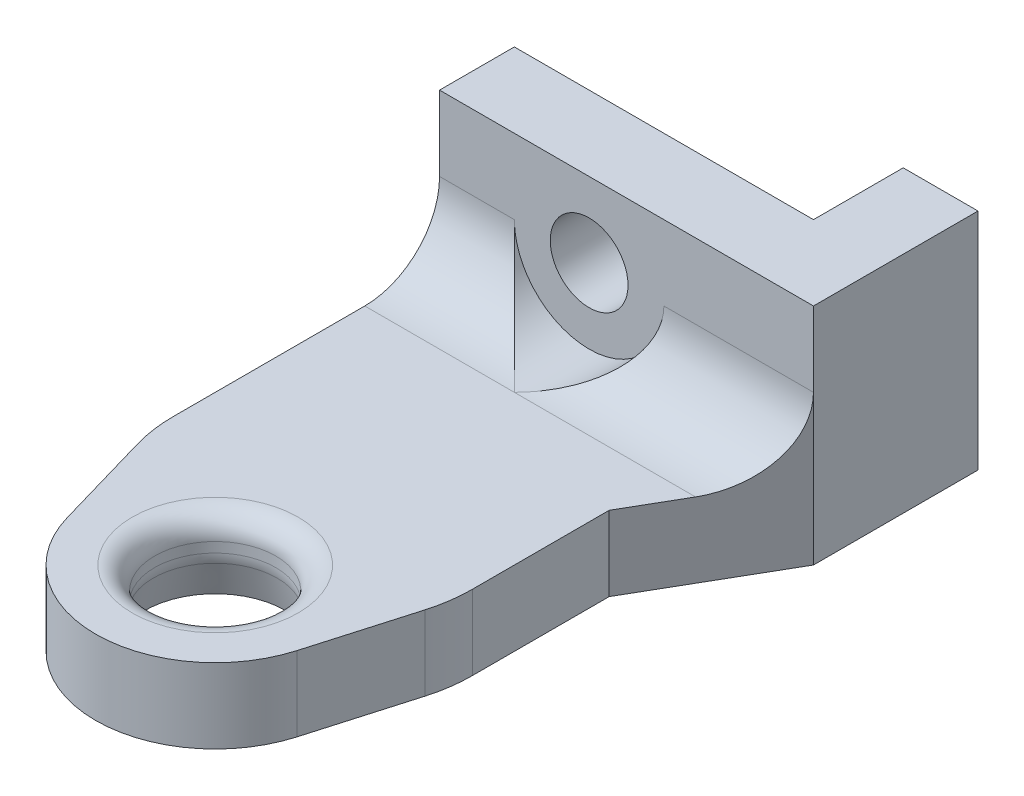
ISO-10303-21;
HEADER;
FILE_DESCRIPTION(('STEP AP214'),'2;1');
FILE_NAME('part.step','',(''),(''),'','','');
FILE_SCHEMA(('AUTOMOTIVE_DESIGN { 1 0 10303 214 1 1 1 1 }'));
ENDSEC;
DATA;
#1=APPLICATION_CONTEXT('core data for automotive mechanical design processes');
#2=APPLICATION_PROTOCOL_DEFINITION('international standard','automotive_design',2000,#1);
#3=PRODUCT_CONTEXT('',#1,'mechanical');
#4=PRODUCT('Part','Part','',(#3));
#5=PRODUCT_RELATED_PRODUCT_CATEGORY('part','',(#4));
#6=PRODUCT_DEFINITION_FORMATION('','',#4);
#7=PRODUCT_DEFINITION_CONTEXT('part definition',#1,'design');
#8=PRODUCT_DEFINITION('design','',#6,#7);
#9=PRODUCT_DEFINITION_SHAPE('','',#8);
#10=(LENGTH_UNIT() NAMED_UNIT(*) SI_UNIT(.MILLI.,.METRE.));
#11=(NAMED_UNIT(*) PLANE_ANGLE_UNIT() SI_UNIT($,.RADIAN.));
#12=(NAMED_UNIT(*) SI_UNIT($,.STERADIAN.) SOLID_ANGLE_UNIT());
#13=UNCERTAINTY_MEASURE_WITH_UNIT(LENGTH_MEASURE(1.E-05),#10,'distance_accuracy_value','');
#14=(GEOMETRIC_REPRESENTATION_CONTEXT(3) GLOBAL_UNCERTAINTY_ASSIGNED_CONTEXT((#13)) GLOBAL_UNIT_ASSIGNED_CONTEXT((#10,
#11,#12)) REPRESENTATION_CONTEXT('',''));
#15=CARTESIAN_POINT('',(0.,0.,0.));
#16=DIRECTION('',(0.,0.,1.));
#17=DIRECTION('',(1.,0.,0.));
#18=AXIS2_PLACEMENT_3D('',#15,#16,#17);
#19=CARTESIAN_POINT('',(20.,5.,0.));
#20=DIRECTION('',(0.,-1.,0.));
#21=DIRECTION('',(0.,0.,-1.));
#22=AXIS2_PLACEMENT_3D('',#19,#20,#21);
#23=CYLINDRICAL_SURFACE('',#22,4.05);
#24=CARTESIAN_POINT('',(20.,2.8291312439685,0.));
#25=DIRECTION('',(0.,1.,0.));
#26=DIRECTION('',(0.,0.,1.));
#27=AXIS2_PLACEMENT_3D('',#24,#25,#26);
#28=CIRCLE('',#27,4.05);
#29=CARTESIAN_POINT('',(20.,2.8291312439685,4.04999999999996));
#30=VERTEX_POINT('',#29);
#31=EDGE_CURVE('E162',#30,#30,#28,.T.);
#32=ORIENTED_EDGE('',*,*,#31,.F.);
#33=EDGE_LOOP('',(#32));
#34=FACE_BOUND('',#33,.T.);
#35=CARTESIAN_POINT('',(20.,3.5,0.));
#36=DIRECTION('',(0.,-1.,0.));
#37=DIRECTION('',(0.,0.,-1.));
#38=AXIS2_PLACEMENT_3D('',#35,#36,#37);
#39=CIRCLE('',#38,4.05);
#40=CARTESIAN_POINT('',(20.,3.5,-4.05000000000004));
#41=VERTEX_POINT('',#40);
#42=EDGE_CURVE('E245',#41,#41,#39,.T.);
#43=ORIENTED_EDGE('',*,*,#42,.F.);
#44=EDGE_LOOP('',(#43));
#45=FACE_BOUND('',#44,.T.);
#46=ADVANCED_FACE('F16',(#34,#45),#23,.F.);
#47=CARTESIAN_POINT('',(20.,10.,7.99999999999997));
#48=DIRECTION('',(0.,0.,-1.));
#49=DIRECTION('',(-1.,0.,0.));
#50=AXIS2_PLACEMENT_3D('',#47,#48,#49);
#51=CYLINDRICAL_SURFACE('',#50,5.);
#52=CARTESIAN_POINT('',(20.,10.,-20.));
#53=DIRECTION('',(-0.707106781186549,0.,-0.707106781186546));
#54=DIRECTION('',(0.707106781186546,0.,-0.707106781186549));
#55=AXIS2_PLACEMENT_3D('',#52,#53,#54);
#56=ELLIPSE('',#55,7.07106781186548,5.);
#57=CARTESIAN_POINT('',(20.,5.,-20.));
#58=VERTEX_POINT('',#57);
#59=CARTESIAN_POINT('',(25.,10.,-25.));
#60=VERTEX_POINT('',#59);
#61=EDGE_CURVE('E166',#58,#60,#56,.F.);
#62=ORIENTED_EDGE('',*,*,#61,.T.);
#63=CARTESIAN_POINT('',(20.,10.,-25.));
#64=DIRECTION('',(0.,0.,-1.));
#65=DIRECTION('',(-1.,0.,0.));
#66=AXIS2_PLACEMENT_3D('',#63,#64,#65);
#67=CIRCLE('',#66,5.);
#68=CARTESIAN_POINT('',(15.,10.,-25.));
#69=VERTEX_POINT('',#68);
#70=EDGE_CURVE('E164',#69,#60,#67,.F.);
#71=ORIENTED_EDGE('',*,*,#70,.F.);
#72=CARTESIAN_POINT('',(20.,10.,-20.));
#73=DIRECTION('',(0.707106781186546,0.,-0.707106781186549));
#74=DIRECTION('',(-0.707106781186549,0.,-0.707106781186546));
#75=AXIS2_PLACEMENT_3D('',#72,#73,#74);
#76=ELLIPSE('',#75,7.07106781186548,5.);
#77=EDGE_CURVE('E150',#69,#58,#76,.F.);
#78=ORIENTED_EDGE('',*,*,#77,.T.);
#79=EDGE_LOOP('',(#62,#71,#78));
#80=FACE_BOUND('',#79,.T.);
#81=ADVANCED_FACE('F165',(#80),#51,.F.);
#82=CARTESIAN_POINT('',(20.,3.5,0.));
#83=DIRECTION('',(0.,-1.,0.));
#84=DIRECTION('',(0.,0.,-1.));
#85=AXIS2_PLACEMENT_3D('',#82,#83,#84);
#86=TOROIDAL_SURFACE('',#85,5.55,1.5);
#87=ORIENTED_EDGE('',*,*,#42,.T.);
#88=EDGE_LOOP('',(#87));
#89=FACE_BOUND('',#88,.T.);
#90=CARTESIAN_POINT('',(20.,5.,0.));
#91=DIRECTION('',(0.,1.,0.));
#92=DIRECTION('',(0.,0.,-1.));
#93=AXIS2_PLACEMENT_3D('',#90,#91,#92);
#94=CIRCLE('',#93,5.55);
#95=CARTESIAN_POINT('',(20.,5.,-5.55000000000004));
#96=VERTEX_POINT('',#95);
#97=CARTESIAN_POINT('',(20.,5.,5.54999999999996));
#98=VERTEX_POINT('',#97);
#99=EDGE_CURVE('E232',#96,#98,#94,.T.);
#100=ORIENTED_EDGE('',*,*,#99,.T.);
#101=CARTESIAN_POINT('',(20.,5.,0.));
#102=DIRECTION('',(0.,1.,0.));
#103=DIRECTION('',(0.,0.,1.));
#104=AXIS2_PLACEMENT_3D('',#101,#102,#103);
#105=CIRCLE('',#104,5.55);
#106=EDGE_CURVE('E291',#98,#96,#105,.T.);
#107=ORIENTED_EDGE('',*,*,#106,.T.);
#108=EDGE_LOOP('',(#100,#107));
#109=FACE_BOUND('',#108,.T.);
#110=ADVANCED_FACE('F220',(#89,#109),#86,.T.);
#111=CARTESIAN_POINT('',(20.,2.8291312439685,0.));
#112=DIRECTION('',(0.,1.,0.));
#113=DIRECTION('',(0.,0.,1.));
#114=AXIS2_PLACEMENT_3D('',#111,#112,#113);
#115=TOROIDAL_SURFACE('',#114,6.55,2.5);
#116=ORIENTED_EDGE('',*,*,#31,.T.);
#117=EDGE_LOOP('',(#116));
#118=FACE_BOUND('',#117,.T.);
#119=CARTESIAN_POINT('',(20.,2.18208363116901,0.));
#120=DIRECTION('',(0.,-1.,0.));
#121=DIRECTION('',(0.,0.,-1.));
#122=AXIS2_PLACEMENT_3D('',#119,#120,#121);
#123=CIRCLE('',#122,4.13518543427923);
#124=CARTESIAN_POINT('',(20.,2.18208363116901,-4.13518543427926));
#125=VERTEX_POINT('',#124);
#126=EDGE_CURVE('E200',#125,#125,#123,.T.);
#127=ORIENTED_EDGE('',*,*,#126,.T.);
#128=EDGE_LOOP('',(#127));
#129=FACE_BOUND('',#128,.T.);
#130=ADVANCED_FACE('F217',(#118,#129),#115,.T.);
#131=CARTESIAN_POINT('',(20.,10.,-20.));
#132=DIRECTION('',(1.,0.,0.));
#133=DIRECTION('',(0.,0.,-1.));
#134=AXIS2_PLACEMENT_3D('',#131,#132,#133);
#135=CYLINDRICAL_SURFACE('',#134,5.);
#136=DIRECTION('',(1.,0.,0.));
#137=VECTOR('',#136,1.);
#138=CARTESIAN_POINT('',(20.,10.,-25.));
#139=LINE('',#138,#137);
#140=CARTESIAN_POINT('',(9.99999999999999,10.,-25.));
#141=VERTEX_POINT('',#140);
#142=EDGE_CURVE('E154',#141,#69,#139,.T.);
#143=ORIENTED_EDGE('',*,*,#142,.F.);
#144=CARTESIAN_POINT('',(10.,10.,-20.));
#145=DIRECTION('',(1.,0.,0.));
#146=DIRECTION('',(0.,0.,-1.));
#147=AXIS2_PLACEMENT_3D('',#144,#145,#146);
#148=CIRCLE('',#147,5.);
#149=CARTESIAN_POINT('',(10.,5.,-20.));
#150=VERTEX_POINT('',#149);
#151=EDGE_CURVE('E277',#141,#150,#148,.F.);
#152=ORIENTED_EDGE('',*,*,#151,.T.);
#153=DIRECTION('',(1.,0.,0.));
#154=VECTOR('',#153,1.);
#155=CARTESIAN_POINT('',(20.,5.,-20.));
#156=LINE('',#155,#154);
#157=EDGE_CURVE('E157',#150,#58,#156,.T.);
#158=ORIENTED_EDGE('',*,*,#157,.T.);
#159=ORIENTED_EDGE('',*,*,#77,.F.);
#160=EDGE_LOOP('',(#143,#152,#158,#159));
#161=FACE_BOUND('',#160,.T.);
#162=ADVANCED_FACE('F152',(#161),#135,.F.);
#163=CARTESIAN_POINT('',(20.,10.,-30.));
#164=DIRECTION('',(0.,0.,1.));
#165=DIRECTION('',(1.,0.,0.));
#166=AXIS2_PLACEMENT_3D('',#163,#164,#165);
#167=CYLINDRICAL_SURFACE('',#166,2.6);
#168=CARTESIAN_POINT('',(20.,10.,-25.));
#169=DIRECTION('',(0.,0.,1.));
#170=DIRECTION('',(1.,0.,0.));
#171=AXIS2_PLACEMENT_3D('',#168,#169,#170);
#172=CIRCLE('',#171,2.6);
#173=CARTESIAN_POINT('',(22.6,10.,-25.));
#174=VERTEX_POINT('',#173);
#175=EDGE_CURVE('E169',#174,#174,#172,.F.);
#176=ORIENTED_EDGE('',*,*,#175,.F.);
#177=EDGE_LOOP('',(#176));
#178=FACE_BOUND('',#177,.T.);
#179=CARTESIAN_POINT('',(20.,10.,-30.));
#180=DIRECTION('',(0.,0.,1.));
#181=DIRECTION('',(1.,0.,0.));
#182=AXIS2_PLACEMENT_3D('',#179,#180,#181);
#183=CIRCLE('',#182,2.6);
#184=CARTESIAN_POINT('',(22.6,10.,-30.));
#185=VERTEX_POINT('',#184);
#186=EDGE_CURVE('E190',#185,#185,#183,.F.);
#187=ORIENTED_EDGE('',*,*,#186,.T.);
#188=EDGE_LOOP('',(#187));
#189=FACE_BOUND('',#188,.T.);
#190=ADVANCED_FACE('F332',(#178,#189),#167,.F.);
#191=CARTESIAN_POINT('',(20.,0.,-25.));
#192=DIRECTION('',(0.,0.,1.));
#193=DIRECTION('',(1.,0.,0.));
#194=AXIS2_PLACEMENT_3D('',#191,#192,#193);
#195=PLANE('',#194);
#196=ORIENTED_EDGE('',*,*,#175,.T.);
#197=EDGE_LOOP('',(#196));
#198=FACE_BOUND('',#197,.T.);
#199=DIRECTION('',(0.,1.,0.));
#200=VECTOR('',#199,1.);
#201=CARTESIAN_POINT('',(35.,0.,-25.));
#202=LINE('',#201,#200);
#203=CARTESIAN_POINT('',(35.,10.,-25.));
#204=VERTEX_POINT('',#203);
#205=CARTESIAN_POINT('',(35.,15.,-25.));
#206=VERTEX_POINT('',#205);
#207=EDGE_CURVE('E445',#204,#206,#202,.T.);
#208=ORIENTED_EDGE('',*,*,#207,.T.);
#209=DIRECTION('',(1.,0.,0.));
#210=VECTOR('',#209,1.);
#211=CARTESIAN_POINT('',(10.,15.,-25.));
#212=LINE('',#211,#210);
#213=CARTESIAN_POINT('',(10.,15.,-25.));
#214=VERTEX_POINT('',#213);
#215=EDGE_CURVE('E294',#214,#206,#212,.T.);
#216=ORIENTED_EDGE('',*,*,#215,.F.);
#217=DIRECTION('',(0.,1.,0.));
#218=VECTOR('',#217,1.);
#219=CARTESIAN_POINT('',(10.,5.,-25.));
#220=LINE('',#219,#218);
#221=EDGE_CURVE('E173',#214,#141,#220,.F.);
#222=ORIENTED_EDGE('',*,*,#221,.T.);
#223=ORIENTED_EDGE('',*,*,#142,.T.);
#224=ORIENTED_EDGE('',*,*,#70,.T.);
#225=DIRECTION('',(1.,0.,0.));
#226=VECTOR('',#225,1.);
#227=CARTESIAN_POINT('',(20.,10.,-25.));
#228=LINE('',#227,#226);
#229=EDGE_CURVE('E292',#60,#204,#228,.T.);
#230=ORIENTED_EDGE('',*,*,#229,.T.);
#231=EDGE_LOOP('',(#208,#216,#222,#223,#224,#230));
#232=FACE_BOUND('',#231,.T.);
#233=ADVANCED_FACE('F171',(#198,#232),#195,.T.);
#234=CARTESIAN_POINT('',(10.,15.,-25.));
#235=DIRECTION('',(0.,1.,0.));
#236=DIRECTION('',(0.,0.,1.));
#237=AXIS2_PLACEMENT_3D('',#234,#235,#236);
#238=PLANE('',#237);
#239=DIRECTION('',(1.,0.,0.));
#240=VECTOR('',#239,1.);
#241=CARTESIAN_POINT('',(35.,15.,-36.));
#242=LINE('',#241,#240);
#243=CARTESIAN_POINT('',(35.,15.,-36.));
#244=VERTEX_POINT('',#243);
#245=CARTESIAN_POINT('',(30.,15.,-36.));
#246=VERTEX_POINT('',#245);
#247=EDGE_CURVE('E183',#244,#246,#242,.F.);
#248=ORIENTED_EDGE('',*,*,#247,.T.);
#249=DIRECTION('',(0.,0.,1.));
#250=VECTOR('',#249,1.);
#251=CARTESIAN_POINT('',(30.,15.,0.));
#252=LINE('',#251,#250);
#253=CARTESIAN_POINT('',(30.,15.,-30.));
#254=VERTEX_POINT('',#253);
#255=EDGE_CURVE('E180',#254,#246,#252,.F.);
#256=ORIENTED_EDGE('',*,*,#255,.F.);
#257=DIRECTION('',(1.,0.,0.));
#258=VECTOR('',#257,1.);
#259=CARTESIAN_POINT('',(30.,15.,-30.));
#260=LINE('',#259,#258);
#261=CARTESIAN_POINT('',(9.99999999999999,15.,-30.));
#262=VERTEX_POINT('',#261);
#263=EDGE_CURVE('E187',#254,#262,#260,.F.);
#264=ORIENTED_EDGE('',*,*,#263,.T.);
#265=DIRECTION('',(0.,0.,-1.));
#266=VECTOR('',#265,1.);
#267=CARTESIAN_POINT('',(10.,15.,-5.77589731211611));
#268=LINE('',#267,#266);
#269=EDGE_CURVE('E193',#262,#214,#268,.F.);
#270=ORIENTED_EDGE('',*,*,#269,.T.);
#271=ORIENTED_EDGE('',*,*,#215,.T.);
#272=DIRECTION('',(0.,0.,1.));
#273=VECTOR('',#272,1.);
#274=CARTESIAN_POINT('',(35.,15.,0.));
#275=LINE('',#274,#273);
#276=EDGE_CURVE('E436',#206,#244,#275,.F.);
#277=ORIENTED_EDGE('',*,*,#276,.T.);
#278=EDGE_LOOP('',(#248,#256,#264,#270,#271,#277));
#279=FACE_BOUND('',#278,.T.);
#280=ADVANCED_FACE('F326',(#279),#238,.T.);
#281=CARTESIAN_POINT('',(20.,10.,-20.));
#282=DIRECTION('',(1.,0.,0.));
#283=DIRECTION('',(0.,0.,-1.));
#284=AXIS2_PLACEMENT_3D('',#281,#282,#283);
#285=CYLINDRICAL_SURFACE('',#284,5.);
#286=DIRECTION('',(1.,0.,0.));
#287=VECTOR('',#286,1.);
#288=CARTESIAN_POINT('',(20.,5.,-20.));
#289=LINE('',#288,#287);
#290=CARTESIAN_POINT('',(32.1132486540519,5.,-20.));
#291=VERTEX_POINT('',#290);
#292=EDGE_CURVE('E201',#58,#291,#289,.T.);
#293=ORIENTED_EDGE('',*,*,#292,.T.);
#294=CARTESIAN_POINT('',(32.1132486540519,10.,-20.));
#295=DIRECTION('',(-0.866025403784442,0.,-0.499999999999994));
#296=DIRECTION('',(0.499999999999994,0.,-0.866025403784442));
#297=AXIS2_PLACEMENT_3D('',#294,#295,#296);
#298=ELLIPSE('',#297,5.77350269189624,5.);
#299=EDGE_CURVE('E269',#291,#204,#298,.F.);
#300=ORIENTED_EDGE('',*,*,#299,.T.);
#301=ORIENTED_EDGE('',*,*,#229,.F.);
#302=ORIENTED_EDGE('',*,*,#61,.F.);
#303=EDGE_LOOP('',(#293,#300,#301,#302));
#304=FACE_BOUND('',#303,.T.);
#305=ADVANCED_FACE('F320',(#304),#285,.F.);
#306=CARTESIAN_POINT('',(20.,5.,0.));
#307=DIRECTION('',(0.,-1.,0.));
#308=DIRECTION('',(0.,0.,-1.));
#309=AXIS2_PLACEMENT_3D('',#306,#307,#308);
#310=PLANE('',#309);
#311=DIRECTION('',(0.,0.,-1.));
#312=VECTOR('',#311,1.);
#313=CARTESIAN_POINT('',(10.,5.,-5.77589731211611));
#314=LINE('',#313,#312);
#315=CARTESIAN_POINT('',(10.,5.,-7.19391244260541));
#316=VERTEX_POINT('',#315);
#317=EDGE_CURVE('E279',#150,#316,#314,.F.);
#318=ORIENTED_EDGE('',*,*,#317,.T.);
#319=CARTESIAN_POINT('',(20.,5.,-7.19391244260542));
#320=DIRECTION('',(0.,-1.,0.));
#321=DIRECTION('',(0.,0.,-1.));
#322=AXIS2_PLACEMENT_3D('',#319,#320,#321);
#323=CIRCLE('',#322,10.);
#324=CARTESIAN_POINT('',(10.3942264078977,5.,-4.41378408275055));
#325=VERTEX_POINT('',#324);
#326=EDGE_CURVE('E280',#325,#316,#323,.T.);
#327=ORIENTED_EDGE('',*,*,#326,.F.);
#328=DIRECTION('',(-0.278012835985487,0.,-0.960577359210234));
#329=VECTOR('',#328,1.);
#330=CARTESIAN_POINT('',(12.3153811263182,5.,2.22410268788388));
#331=LINE('',#330,#329);
#332=CARTESIAN_POINT('',(12.3153811263181,5.,2.22410268788387));
#333=VERTEX_POINT('',#332);
#334=EDGE_CURVE('E202',#325,#333,#331,.F.);
#335=ORIENTED_EDGE('',*,*,#334,.T.);
#336=CARTESIAN_POINT('',(20.,5.,0.));
#337=DIRECTION('',(0.,-1.,0.));
#338=DIRECTION('',(0.,0.,-1.));
#339=AXIS2_PLACEMENT_3D('',#336,#337,#338);
#340=CIRCLE('',#339,8.00000000000001);
#341=CARTESIAN_POINT('',(27.6846188736819,5.,2.22410268788385));
#342=VERTEX_POINT('',#341);
#343=EDGE_CURVE('E206',#342,#333,#340,.T.);
#344=ORIENTED_EDGE('',*,*,#343,.F.);
#345=DIRECTION('',(-0.278012835985484,0.,0.960577359210235));
#346=VECTOR('',#345,1.);
#347=CARTESIAN_POINT('',(27.6846188736819,5.,2.22410268788386));
#348=LINE('',#347,#346);
#349=CARTESIAN_POINT('',(29.6057735921024,5.,-4.41378408275058));
#350=VERTEX_POINT('',#349);
#351=EDGE_CURVE('E207',#342,#350,#348,.F.);
#352=ORIENTED_EDGE('',*,*,#351,.T.);
#353=CARTESIAN_POINT('',(20.,5.,-7.19391244260542));
#354=DIRECTION('',(0.,-1.,0.));
#355=DIRECTION('',(0.,0.,-1.));
#356=AXIS2_PLACEMENT_3D('',#353,#354,#355);
#357=CIRCLE('',#356,10.);
#358=CARTESIAN_POINT('',(30.,5.,-7.19391244260543));
#359=VERTEX_POINT('',#358);
#360=EDGE_CURVE('E287',#359,#350,#357,.T.);
#361=ORIENTED_EDGE('',*,*,#360,.F.);
#362=DIRECTION('',(0.,0.,1.));
#363=VECTOR('',#362,1.);
#364=CARTESIAN_POINT('',(30.,5.,-5.77589731211614));
#365=LINE('',#364,#363);
#366=CARTESIAN_POINT('',(30.,5.,-16.3397459621556));
#367=VERTEX_POINT('',#366);
#368=EDGE_CURVE('E268',#359,#367,#365,.F.);
#369=ORIENTED_EDGE('',*,*,#368,.T.);
#370=DIRECTION('',(-0.499999999999994,0.,0.866025403784442));
#371=VECTOR('',#370,1.);
#372=CARTESIAN_POINT('',(35.,5.,-25.));
#373=LINE('',#372,#371);
#374=EDGE_CURVE('E273',#367,#291,#373,.F.);
#375=ORIENTED_EDGE('',*,*,#374,.T.);
#376=ORIENTED_EDGE('',*,*,#292,.F.);
#377=ORIENTED_EDGE('',*,*,#157,.F.);
#378=EDGE_LOOP('',(#318,#327,#335,#344,#352,#361,#369,#375,#376,#377));
#379=FACE_BOUND('',#378,.T.);
#380=ORIENTED_EDGE('',*,*,#106,.F.);
#381=ORIENTED_EDGE('',*,*,#99,.F.);
#382=EDGE_LOOP('',(#380,#381));
#383=FACE_BOUND('',#382,.T.);
#384=ADVANCED_FACE('F299',(#379,#383),#310,.F.);
#385=CARTESIAN_POINT('',(20.,-5.6843418860808E-11,0.));
#386=DIRECTION('',(0.,-1.,0.));
#387=DIRECTION('',(0.,0.,-1.));
#388=AXIS2_PLACEMENT_3D('',#385,#386,#387);
#389=CONICAL_SURFACE('',#388,4.7198729810702,0.261799387793521);
#390=CARTESIAN_POINT('',(20.,-5.6843418860808E-11,0.));
#391=DIRECTION('',(0.,-1.,0.));
#392=DIRECTION('',(0.,0.,-1.));
#393=AXIS2_PLACEMENT_3D('',#390,#391,#392);
#394=CIRCLE('',#393,4.7198729810702);
#395=CARTESIAN_POINT('',(20.,-5.6843418860808E-11,-4.71987298107024));
#396=VERTEX_POINT('',#395);
#397=EDGE_CURVE('E264',#396,#396,#394,.F.);
#398=ORIENTED_EDGE('',*,*,#397,.F.);
#399=EDGE_LOOP('',(#398));
#400=FACE_BOUND('',#399,.T.);
#401=ORIENTED_EDGE('',*,*,#126,.F.);
#402=EDGE_LOOP('',(#401));
#403=FACE_BOUND('',#402,.T.);
#404=ADVANCED_FACE('F319',(#400,#403),#389,.F.);
#405=CARTESIAN_POINT('',(20.,5.,-7.19391244260542));
#406=DIRECTION('',(0.,-1.,0.));
#407=DIRECTION('',(0.,0.,-1.));
#408=AXIS2_PLACEMENT_3D('',#405,#406,#407);
#409=CYLINDRICAL_SURFACE('',#408,10.);
#410=CARTESIAN_POINT('',(20.,0.,-7.19391244260542));
#411=DIRECTION('',(0.,-1.,0.));
#412=DIRECTION('',(0.,0.,-1.));
#413=AXIS2_PLACEMENT_3D('',#410,#411,#412);
#414=CIRCLE('',#413,10.);
#415=CARTESIAN_POINT('',(30.,0.,-7.19391244260542));
#416=VERTEX_POINT('',#415);
#417=CARTESIAN_POINT('',(29.6057735921024,0.,-4.41378408275058));
#418=VERTEX_POINT('',#417);
#419=EDGE_CURVE('E260',#416,#418,#414,.T.);
#420=ORIENTED_EDGE('',*,*,#419,.F.);
#421=DIRECTION('',(0.,1.,0.));
#422=VECTOR('',#421,1.);
#423=CARTESIAN_POINT('',(30.,5.,-7.19391244260543));
#424=LINE('',#423,#422);
#425=EDGE_CURVE('E402',#416,#359,#424,.T.);
#426=ORIENTED_EDGE('',*,*,#425,.T.);
#427=ORIENTED_EDGE('',*,*,#360,.T.);
#428=DIRECTION('',(0.,1.,0.));
#429=VECTOR('',#428,1.);
#430=CARTESIAN_POINT('',(29.6057735921024,5.,-4.41378408275058));
#431=LINE('',#430,#429);
#432=EDGE_CURVE('E212',#350,#418,#431,.F.);
#433=ORIENTED_EDGE('',*,*,#432,.T.);
#434=EDGE_LOOP('',(#420,#426,#427,#433));
#435=FACE_BOUND('',#434,.T.);
#436=ADVANCED_FACE('F392',(#435),#409,.T.);
#437=CARTESIAN_POINT('',(27.6846188736819,5.,2.22410268788386));
#438=DIRECTION('',(-0.960577359210235,0.,-0.278012835985484));
#439=DIRECTION('',(-0.278012835985484,0.,0.960577359210235));
#440=AXIS2_PLACEMENT_3D('',#437,#438,#439);
#441=PLANE('',#440);
#442=DIRECTION('',(0.,-1.,0.));
#443=VECTOR('',#442,1.);
#444=CARTESIAN_POINT('',(27.6846188736819,5.,2.22410268788386));
#445=LINE('',#444,#443);
#446=CARTESIAN_POINT('',(27.6846188736819,0.,2.22410268788385));
#447=VERTEX_POINT('',#446);
#448=EDGE_CURVE('E211',#447,#342,#445,.F.);
#449=ORIENTED_EDGE('',*,*,#448,.F.);
#450=DIRECTION('',(-0.278012835985484,0.,0.960577359210235));
#451=VECTOR('',#450,1.);
#452=CARTESIAN_POINT('',(29.6057735921024,0.,-4.41378408275058));
#453=LINE('',#452,#451);
#454=EDGE_CURVE('E259',#418,#447,#453,.T.);
#455=ORIENTED_EDGE('',*,*,#454,.F.);
#456=ORIENTED_EDGE('',*,*,#432,.F.);
#457=ORIENTED_EDGE('',*,*,#351,.F.);
#458=EDGE_LOOP('',(#449,#455,#456,#457));
#459=FACE_BOUND('',#458,.T.);
#460=ADVANCED_FACE('F389',(#459),#441,.F.);
#461=CARTESIAN_POINT('',(20.,5.,0.));
#462=DIRECTION('',(0.,-1.,0.));
#463=DIRECTION('',(0.,0.,-1.));
#464=AXIS2_PLACEMENT_3D('',#461,#462,#463);
#465=CYLINDRICAL_SURFACE('',#464,8.00000000000001);
#466=ORIENTED_EDGE('',*,*,#343,.T.);
#467=DIRECTION('',(0.,1.,0.));
#468=VECTOR('',#467,1.);
#469=CARTESIAN_POINT('',(12.3153811263182,5.,2.22410268788388));
#470=LINE('',#469,#468);
#471=CARTESIAN_POINT('',(12.3153811263181,0.,2.22410268788387));
#472=VERTEX_POINT('',#471);
#473=EDGE_CURVE('E205',#333,#472,#470,.F.);
#474=ORIENTED_EDGE('',*,*,#473,.T.);
#475=CARTESIAN_POINT('',(20.,0.,0.));
#476=DIRECTION('',(0.,-1.,0.));
#477=DIRECTION('',(0.,0.,-1.));
#478=AXIS2_PLACEMENT_3D('',#475,#476,#477);
#479=CIRCLE('',#478,8.00000000000001);
#480=EDGE_CURVE('E255',#447,#472,#479,.T.);
#481=ORIENTED_EDGE('',*,*,#480,.F.);
#482=ORIENTED_EDGE('',*,*,#448,.T.);
#483=EDGE_LOOP('',(#466,#474,#481,#482));
#484=FACE_BOUND('',#483,.T.);
#485=ADVANCED_FACE('F385',(#484),#465,.T.);
#486=CARTESIAN_POINT('',(12.3153811263182,5.,2.22410268788388));
#487=DIRECTION('',(0.960577359210234,0.,-0.278012835985487));
#488=DIRECTION('',(-0.278012835985487,0.,-0.960577359210234));
#489=AXIS2_PLACEMENT_3D('',#486,#487,#488);
#490=PLANE('',#489);
#491=ORIENTED_EDGE('',*,*,#473,.F.);
#492=ORIENTED_EDGE('',*,*,#334,.F.);
#493=DIRECTION('',(0.,-1.,0.));
#494=VECTOR('',#493,1.);
#495=CARTESIAN_POINT('',(10.3942264078977,5.,-4.41378408275055));
#496=LINE('',#495,#494);
#497=CARTESIAN_POINT('',(10.3942264078977,0.,-4.41378408275055));
#498=VERTEX_POINT('',#497);
#499=EDGE_CURVE('E196',#498,#325,#496,.F.);
#500=ORIENTED_EDGE('',*,*,#499,.F.);
#501=DIRECTION('',(-0.278012835985487,0.,-0.960577359210234));
#502=VECTOR('',#501,1.);
#503=CARTESIAN_POINT('',(12.3153811263182,0.,2.22410268788388));
#504=LINE('',#503,#502);
#505=EDGE_CURVE('E254',#472,#498,#504,.T.);
#506=ORIENTED_EDGE('',*,*,#505,.F.);
#507=EDGE_LOOP('',(#491,#492,#500,#506));
#508=FACE_BOUND('',#507,.T.);
#509=ADVANCED_FACE('F381',(#508),#490,.F.);
#510=CARTESIAN_POINT('',(20.,5.,-7.19391244260542));
#511=DIRECTION('',(0.,-1.,0.));
#512=DIRECTION('',(0.,0.,-1.));
#513=AXIS2_PLACEMENT_3D('',#510,#511,#512);
#514=CYLINDRICAL_SURFACE('',#513,10.);
#515=CARTESIAN_POINT('',(20.,0.,-7.19391244260542));
#516=DIRECTION('',(0.,-1.,0.));
#517=DIRECTION('',(0.,0.,-1.));
#518=AXIS2_PLACEMENT_3D('',#515,#516,#517);
#519=CIRCLE('',#518,10.);
#520=CARTESIAN_POINT('',(10.,0.,-7.19391244260541));
#521=VERTEX_POINT('',#520);
#522=EDGE_CURVE('E249',#498,#521,#519,.T.);
#523=ORIENTED_EDGE('',*,*,#522,.F.);
#524=ORIENTED_EDGE('',*,*,#499,.T.);
#525=ORIENTED_EDGE('',*,*,#326,.T.);
#526=DIRECTION('',(0.,1.,0.));
#527=VECTOR('',#526,1.);
#528=CARTESIAN_POINT('',(10.,5.,-7.19391244260541));
#529=LINE('',#528,#527);
#530=EDGE_CURVE('E276',#316,#521,#529,.F.);
#531=ORIENTED_EDGE('',*,*,#530,.T.);
#532=EDGE_LOOP('',(#523,#524,#525,#531));
#533=FACE_BOUND('',#532,.T.);
#534=ADVANCED_FACE('F377',(#533),#514,.T.);
#535=CARTESIAN_POINT('',(10.,5.,-5.77589731211611));
#536=DIRECTION('',(1.,0.,0.));
#537=DIRECTION('',(0.,0.,-1.));
#538=AXIS2_PLACEMENT_3D('',#535,#536,#537);
#539=PLANE('',#538);
#540=ORIENTED_EDGE('',*,*,#530,.F.);
#541=ORIENTED_EDGE('',*,*,#317,.F.);
#542=ORIENTED_EDGE('',*,*,#151,.F.);
#543=ORIENTED_EDGE('',*,*,#221,.F.);
#544=ORIENTED_EDGE('',*,*,#269,.F.);
#545=DIRECTION('',(0.,1.,0.));
#546=VECTOR('',#545,1.);
#547=CARTESIAN_POINT('',(9.99999999999999,5.,-30.));
#548=LINE('',#547,#546);
#549=CARTESIAN_POINT('',(10.,0.,-30.));
#550=VERTEX_POINT('',#549);
#551=EDGE_CURVE('E189',#262,#550,#548,.F.);
#552=ORIENTED_EDGE('',*,*,#551,.T.);
#553=DIRECTION('',(0.,0.,-1.));
#554=VECTOR('',#553,1.);
#555=CARTESIAN_POINT('',(10.,0.,0.));
#556=LINE('',#555,#554);
#557=EDGE_CURVE('E253',#521,#550,#556,.T.);
#558=ORIENTED_EDGE('',*,*,#557,.F.);
#559=EDGE_LOOP('',(#540,#541,#542,#543,#544,#552,#558));
#560=FACE_BOUND('',#559,.T.);
#561=ADVANCED_FACE('F373',(#560),#539,.F.);
#562=CARTESIAN_POINT('',(30.,5.,-30.));
#563=DIRECTION('',(0.,0.,1.));
#564=DIRECTION('',(1.,0.,0.));
#565=AXIS2_PLACEMENT_3D('',#562,#563,#564);
#566=PLANE('',#565);
#567=ORIENTED_EDGE('',*,*,#551,.F.);
#568=ORIENTED_EDGE('',*,*,#263,.F.);
#569=DIRECTION('',(0.,1.,0.));
#570=VECTOR('',#569,1.);
#571=CARTESIAN_POINT('',(30.,0.,-30.));
#572=LINE('',#571,#570);
#573=CARTESIAN_POINT('',(30.,0.,-30.));
#574=VERTEX_POINT('',#573);
#575=EDGE_CURVE('E184',#574,#254,#572,.T.);
#576=ORIENTED_EDGE('',*,*,#575,.F.);
#577=DIRECTION('',(1.,0.,0.));
#578=VECTOR('',#577,1.);
#579=CARTESIAN_POINT('',(20.,0.,-30.));
#580=LINE('',#579,#578);
#581=EDGE_CURVE('E450',#550,#574,#580,.T.);
#582=ORIENTED_EDGE('',*,*,#581,.F.);
#583=EDGE_LOOP('',(#567,#568,#576,#582));
#584=FACE_BOUND('',#583,.T.);
#585=ORIENTED_EDGE('',*,*,#186,.F.);
#586=EDGE_LOOP('',(#585));
#587=FACE_BOUND('',#586,.T.);
#588=ADVANCED_FACE('F369',(#584,#587),#566,.F.);
#589=CARTESIAN_POINT('',(30.,0.,0.));
#590=DIRECTION('',(-1.,0.,0.));
#591=DIRECTION('',(0.,0.,1.));
#592=AXIS2_PLACEMENT_3D('',#589,#590,#591);
#593=PLANE('',#592);
#594=DIRECTION('',(0.,1.,0.));
#595=VECTOR('',#594,1.);
#596=CARTESIAN_POINT('',(30.,15.,-36.));
#597=LINE('',#596,#595);
#598=CARTESIAN_POINT('',(30.,0.,-36.));
#599=VERTEX_POINT('',#598);
#600=EDGE_CURVE('E443',#246,#599,#597,.F.);
#601=ORIENTED_EDGE('',*,*,#600,.T.);
#602=DIRECTION('',(0.,0.,-1.));
#603=VECTOR('',#602,1.);
#604=CARTESIAN_POINT('',(30.,0.,0.));
#605=LINE('',#604,#603);
#606=EDGE_CURVE('E440',#574,#599,#605,.T.);
#607=ORIENTED_EDGE('',*,*,#606,.F.);
#608=ORIENTED_EDGE('',*,*,#575,.T.);
#609=ORIENTED_EDGE('',*,*,#255,.T.);
#610=EDGE_LOOP('',(#601,#607,#608,#609));
#611=FACE_BOUND('',#610,.T.);
#612=ADVANCED_FACE('F365',(#611),#593,.T.);
#613=CARTESIAN_POINT('',(35.,15.,-36.));
#614=DIRECTION('',(0.,0.,1.));
#615=DIRECTION('',(1.,0.,0.));
#616=AXIS2_PLACEMENT_3D('',#613,#614,#615);
#617=PLANE('',#616);
#618=ORIENTED_EDGE('',*,*,#247,.F.);
#619=DIRECTION('',(0.,1.,0.));
#620=VECTOR('',#619,1.);
#621=CARTESIAN_POINT('',(35.,0.,-36.));
#622=LINE('',#621,#620);
#623=CARTESIAN_POINT('',(35.,0.,-36.));
#624=VERTEX_POINT('',#623);
#625=EDGE_CURVE('E430',#244,#624,#622,.F.);
#626=ORIENTED_EDGE('',*,*,#625,.T.);
#627=DIRECTION('',(1.,0.,0.));
#628=VECTOR('',#627,1.);
#629=CARTESIAN_POINT('',(20.,0.,-36.));
#630=LINE('',#629,#628);
#631=EDGE_CURVE('E416',#599,#624,#630,.T.);
#632=ORIENTED_EDGE('',*,*,#631,.F.);
#633=ORIENTED_EDGE('',*,*,#600,.F.);
#634=EDGE_LOOP('',(#618,#626,#632,#633));
#635=FACE_BOUND('',#634,.T.);
#636=ADVANCED_FACE('F361',(#635),#617,.F.);
#637=CARTESIAN_POINT('',(35.,0.,0.));
#638=DIRECTION('',(-1.,0.,0.));
#639=DIRECTION('',(0.,0.,1.));
#640=AXIS2_PLACEMENT_3D('',#637,#638,#639);
#641=PLANE('',#640);
#642=DIRECTION('',(0.,0.,-1.));
#643=VECTOR('',#642,1.);
#644=CARTESIAN_POINT('',(35.,0.,0.));
#645=LINE('',#644,#643);
#646=CARTESIAN_POINT('',(35.,0.,-25.));
#647=VERTEX_POINT('',#646);
#648=EDGE_CURVE('E413',#624,#647,#645,.F.);
#649=ORIENTED_EDGE('',*,*,#648,.F.);
#650=ORIENTED_EDGE('',*,*,#625,.F.);
#651=ORIENTED_EDGE('',*,*,#276,.F.);
#652=ORIENTED_EDGE('',*,*,#207,.F.);
#653=DIRECTION('',(0.,1.,0.));
#654=VECTOR('',#653,1.);
#655=CARTESIAN_POINT('',(35.,0.,-25.));
#656=LINE('',#655,#654);
#657=EDGE_CURVE('E272',#204,#647,#656,.F.);
#658=ORIENTED_EDGE('',*,*,#657,.T.);
#659=EDGE_LOOP('',(#649,#650,#651,#652,#658));
#660=FACE_BOUND('',#659,.T.);
#661=ADVANCED_FACE('F358',(#660),#641,.F.);
#662=CARTESIAN_POINT('',(35.,0.,-25.));
#663=DIRECTION('',(-0.866025403784442,0.,-0.499999999999994));
#664=DIRECTION('',(-0.499999999999994,0.,0.866025403784442));
#665=AXIS2_PLACEMENT_3D('',#662,#663,#664);
#666=PLANE('',#665);
#667=ORIENTED_EDGE('',*,*,#657,.F.);
#668=ORIENTED_EDGE('',*,*,#299,.F.);
#669=ORIENTED_EDGE('',*,*,#374,.F.);
#670=DIRECTION('',(0.,1.,0.));
#671=VECTOR('',#670,1.);
#672=CARTESIAN_POINT('',(30.,5.,-16.3397459621556));
#673=LINE('',#672,#671);
#674=CARTESIAN_POINT('',(30.,0.,-16.3397459621556));
#675=VERTEX_POINT('',#674);
#676=EDGE_CURVE('E37',#367,#675,#673,.F.);
#677=ORIENTED_EDGE('',*,*,#676,.T.);
#678=DIRECTION('',(-0.499999999999994,0.,0.866025403784442));
#679=VECTOR('',#678,1.);
#680=CARTESIAN_POINT('',(35.,0.,-25.));
#681=LINE('',#680,#679);
#682=EDGE_CURVE('E28',#647,#675,#681,.T.);
#683=ORIENTED_EDGE('',*,*,#682,.F.);
#684=EDGE_LOOP('',(#667,#668,#669,#677,#683));
#685=FACE_BOUND('',#684,.T.);
#686=ADVANCED_FACE('F350',(#685),#666,.F.);
#687=CARTESIAN_POINT('',(30.,5.,-5.77589731211614));
#688=DIRECTION('',(-1.,0.,0.));
#689=DIRECTION('',(0.,0.,1.));
#690=AXIS2_PLACEMENT_3D('',#687,#688,#689);
#691=PLANE('',#690);
#692=ORIENTED_EDGE('',*,*,#425,.F.);
#693=DIRECTION('',(0.,0.,-1.));
#694=VECTOR('',#693,1.);
#695=CARTESIAN_POINT('',(30.,0.,0.));
#696=LINE('',#695,#694);
#697=EDGE_CURVE('E11',#675,#416,#696,.F.);
#698=ORIENTED_EDGE('',*,*,#697,.F.);
#699=ORIENTED_EDGE('',*,*,#676,.F.);
#700=ORIENTED_EDGE('',*,*,#368,.F.);
#701=EDGE_LOOP('',(#692,#698,#699,#700));
#702=FACE_BOUND('',#701,.T.);
#703=ADVANCED_FACE('F344',(#702),#691,.F.);
#704=CARTESIAN_POINT('',(20.,0.,0.));
#705=DIRECTION('',(0.,-1.,0.));
#706=DIRECTION('',(0.,0.,-1.));
#707=AXIS2_PLACEMENT_3D('',#704,#705,#706);
#708=PLANE('',#707);
#709=ORIENTED_EDGE('',*,*,#682,.T.);
#710=ORIENTED_EDGE('',*,*,#697,.T.);
#711=ORIENTED_EDGE('',*,*,#419,.T.);
#712=ORIENTED_EDGE('',*,*,#454,.T.);
#713=ORIENTED_EDGE('',*,*,#480,.T.);
#714=ORIENTED_EDGE('',*,*,#505,.T.);
#715=ORIENTED_EDGE('',*,*,#522,.T.);
#716=ORIENTED_EDGE('',*,*,#557,.T.);
#717=ORIENTED_EDGE('',*,*,#581,.T.);
#718=ORIENTED_EDGE('',*,*,#606,.T.);
#719=ORIENTED_EDGE('',*,*,#631,.T.);
#720=ORIENTED_EDGE('',*,*,#648,.T.);
#721=EDGE_LOOP('',(#709,#710,#711,#712,#713,#714,#715,#716,#717,#718,#719,#720));
#722=FACE_BOUND('',#721,.T.);
#723=ORIENTED_EDGE('',*,*,#397,.T.);
#724=EDGE_LOOP('',(#723));
#725=FACE_BOUND('',#724,.T.);
#726=ADVANCED_FACE('F342',(#722,#725),#708,.T.);
#727=CLOSED_SHELL('',(#46,#81,#110,#130,#162,#190,#233,#280,#305,#384,#404,#436,#460,#485,#509,
#534,#561,#588,#612,#636,#661,#686,#703,#726));
#728=MANIFOLD_SOLID_BREP('B1',#727);
#729=ADVANCED_BREP_SHAPE_REPRESENTATION('',(#18,#728),#14);
#730=SHAPE_DEFINITION_REPRESENTATION(#9,#729);
ENDSEC;
END-ISO-10303-21;
